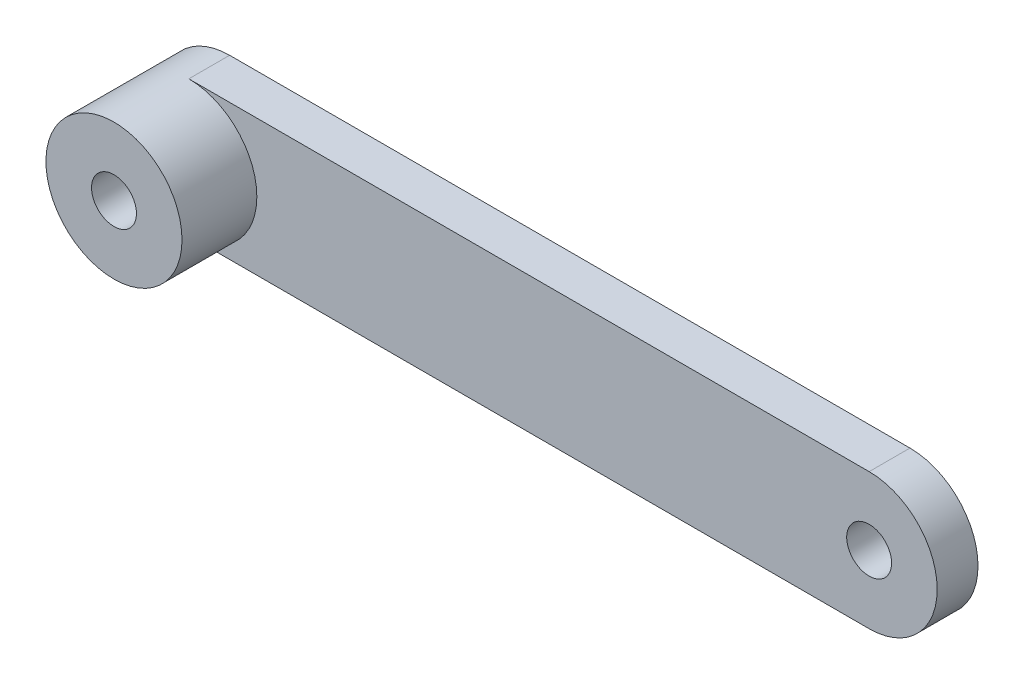
ISO-10303-21;
HEADER;
FILE_DESCRIPTION(('STEP AP214'),'2;1');
FILE_NAME('part.step','',(''),(''),'','','');
FILE_SCHEMA(('AUTOMOTIVE_DESIGN { 1 0 10303 214 1 1 1 1 }'));
ENDSEC;
DATA;
#1=APPLICATION_CONTEXT('core data for automotive mechanical design processes');
#2=APPLICATION_PROTOCOL_DEFINITION('international standard','automotive_design',2000,#1);
#3=PRODUCT_CONTEXT('',#1,'mechanical');
#4=PRODUCT('Part','Part','',(#3));
#5=PRODUCT_RELATED_PRODUCT_CATEGORY('part','',(#4));
#6=PRODUCT_DEFINITION_FORMATION('','',#4);
#7=PRODUCT_DEFINITION_CONTEXT('part definition',#1,'design');
#8=PRODUCT_DEFINITION('design','',#6,#7);
#9=PRODUCT_DEFINITION_SHAPE('','',#8);
#10=(LENGTH_UNIT() NAMED_UNIT(*) SI_UNIT(.MILLI.,.METRE.));
#11=(NAMED_UNIT(*) PLANE_ANGLE_UNIT() SI_UNIT($,.RADIAN.));
#12=(NAMED_UNIT(*) SI_UNIT($,.STERADIAN.) SOLID_ANGLE_UNIT());
#13=UNCERTAINTY_MEASURE_WITH_UNIT(LENGTH_MEASURE(1.E-05),#10,'distance_accuracy_value','');
#14=(GEOMETRIC_REPRESENTATION_CONTEXT(3) GLOBAL_UNCERTAINTY_ASSIGNED_CONTEXT((#13)) GLOBAL_UNIT_ASSIGNED_CONTEXT((#10,
#11,#12)) REPRESENTATION_CONTEXT('',''));
#15=CARTESIAN_POINT('',(0.,0.,0.));
#16=DIRECTION('',(0.,0.,1.));
#17=DIRECTION('',(1.,0.,0.));
#18=AXIS2_PLACEMENT_3D('',#15,#16,#17);
#19=CARTESIAN_POINT('',(0.,0.,3.));
#20=DIRECTION('',(0.,0.,1.));
#21=DIRECTION('',(1.,0.,0.));
#22=AXIS2_PLACEMENT_3D('',#19,#20,#21);
#23=PLANE('',#22);
#24=CARTESIAN_POINT('',(0.,0.,3.));
#25=DIRECTION('',(0.,0.,1.));
#26=DIRECTION('',(1.,0.,0.));
#27=AXIS2_PLACEMENT_3D('',#24,#25,#26);
#28=CIRCLE('',#27,5.);
#29=CARTESIAN_POINT('',(0.,-5.,3.));
#30=VERTEX_POINT('',#29);
#31=CARTESIAN_POINT('',(0.,5.,3.));
#32=VERTEX_POINT('',#31);
#33=EDGE_CURVE('E11',#30,#32,#28,.T.);
#34=ORIENTED_EDGE('',*,*,#33,.F.);
#35=DIRECTION('',(1.,0.,0.));
#36=VECTOR('',#35,1.);
#37=CARTESIAN_POINT('',(0.,-5.,3.));
#38=LINE('',#37,#36);
#39=CARTESIAN_POINT('',(50.,-5.,3.));
#40=VERTEX_POINT('',#39);
#41=EDGE_CURVE('E101',#30,#40,#38,.T.);
#42=ORIENTED_EDGE('',*,*,#41,.T.);
#43=CARTESIAN_POINT('',(50.,0.,3.));
#44=DIRECTION('',(0.,0.,1.));
#45=DIRECTION('',(1.,0.,0.));
#46=AXIS2_PLACEMENT_3D('',#43,#44,#45);
#47=CIRCLE('',#46,5.);
#48=CARTESIAN_POINT('',(50.,5.,3.));
#49=VERTEX_POINT('',#48);
#50=EDGE_CURVE('E52',#40,#49,#47,.T.);
#51=ORIENTED_EDGE('',*,*,#50,.T.);
#52=DIRECTION('',(-1.,0.,0.));
#53=VECTOR('',#52,1.);
#54=CARTESIAN_POINT('',(0.,5.,3.));
#55=LINE('',#54,#53);
#56=EDGE_CURVE('E83',#49,#32,#55,.T.);
#57=ORIENTED_EDGE('',*,*,#56,.T.);
#58=EDGE_LOOP('',(#34,#42,#51,#57));
#59=FACE_BOUND('',#58,.T.);
#60=CARTESIAN_POINT('',(50.,0.,3.));
#61=DIRECTION('',(0.,0.,1.));
#62=DIRECTION('',(1.,0.,0.));
#63=AXIS2_PLACEMENT_3D('',#60,#61,#62);
#64=CIRCLE('',#63,1.65);
#65=CARTESIAN_POINT('',(51.65,0.,3.));
#66=VERTEX_POINT('',#65);
#67=EDGE_CURVE('E119',#66,#66,#64,.T.);
#68=ORIENTED_EDGE('',*,*,#67,.F.);
#69=EDGE_LOOP('',(#68));
#70=FACE_BOUND('',#69,.T.);
#71=ADVANCED_FACE('F33',(#59,#70),#23,.T.);
#72=CARTESIAN_POINT('',(0.,0.,0.));
#73=DIRECTION('',(0.,0.,1.));
#74=DIRECTION('',(1.,0.,0.));
#75=AXIS2_PLACEMENT_3D('',#72,#73,#74);
#76=PLANE('',#75);
#77=CARTESIAN_POINT('',(0.,0.,0.));
#78=DIRECTION('',(0.,0.,1.));
#79=DIRECTION('',(1.,0.,0.));
#80=AXIS2_PLACEMENT_3D('',#77,#78,#79);
#81=CIRCLE('',#80,1.65);
#82=CARTESIAN_POINT('',(1.65,0.,0.));
#83=VERTEX_POINT('',#82);
#84=EDGE_CURVE('E115',#83,#83,#81,.T.);
#85=ORIENTED_EDGE('',*,*,#84,.T.);
#86=EDGE_LOOP('',(#85));
#87=FACE_BOUND('',#86,.T.);
#88=CARTESIAN_POINT('',(0.,0.,0.));
#89=DIRECTION('',(0.,0.,1.));
#90=DIRECTION('',(1.,0.,0.));
#91=AXIS2_PLACEMENT_3D('',#88,#89,#90);
#92=CIRCLE('',#91,5.);
#93=CARTESIAN_POINT('',(0.,5.,0.));
#94=VERTEX_POINT('',#93);
#95=CARTESIAN_POINT('',(0.,-5.,0.));
#96=VERTEX_POINT('',#95);
#97=EDGE_CURVE('E94',#94,#96,#92,.T.);
#98=ORIENTED_EDGE('',*,*,#97,.F.);
#99=DIRECTION('',(-1.,0.,0.));
#100=VECTOR('',#99,1.);
#101=CARTESIAN_POINT('',(0.,5.,0.));
#102=LINE('',#101,#100);
#103=CARTESIAN_POINT('',(50.,5.,0.));
#104=VERTEX_POINT('',#103);
#105=EDGE_CURVE('E75',#104,#94,#102,.T.);
#106=ORIENTED_EDGE('',*,*,#105,.F.);
#107=CARTESIAN_POINT('',(50.,0.,0.));
#108=DIRECTION('',(0.,0.,1.));
#109=DIRECTION('',(1.,0.,0.));
#110=AXIS2_PLACEMENT_3D('',#107,#108,#109);
#111=CIRCLE('',#110,5.);
#112=CARTESIAN_POINT('',(50.,-5.,0.));
#113=VERTEX_POINT('',#112);
#114=EDGE_CURVE('E69',#113,#104,#111,.T.);
#115=ORIENTED_EDGE('',*,*,#114,.F.);
#116=DIRECTION('',(1.,0.,0.));
#117=VECTOR('',#116,1.);
#118=CARTESIAN_POINT('',(0.,-5.,0.));
#119=LINE('',#118,#117);
#120=EDGE_CURVE('E112',#96,#113,#119,.T.);
#121=ORIENTED_EDGE('',*,*,#120,.F.);
#122=EDGE_LOOP('',(#98,#106,#115,#121));
#123=FACE_BOUND('',#122,.T.);
#124=CARTESIAN_POINT('',(50.,0.,0.));
#125=DIRECTION('',(0.,0.,1.));
#126=DIRECTION('',(1.,0.,0.));
#127=AXIS2_PLACEMENT_3D('',#124,#125,#126);
#128=CIRCLE('',#127,1.65);
#129=CARTESIAN_POINT('',(51.65,0.,0.));
#130=VERTEX_POINT('',#129);
#131=EDGE_CURVE('E120',#130,#130,#128,.T.);
#132=ORIENTED_EDGE('',*,*,#131,.T.);
#133=EDGE_LOOP('',(#132));
#134=FACE_BOUND('',#133,.T.);
#135=ADVANCED_FACE('F145',(#87,#123,#134),#76,.F.);
#136=CARTESIAN_POINT('',(0.,0.,3.));
#137=DIRECTION('',(0.,0.,-1.));
#138=DIRECTION('',(-1.,0.,0.));
#139=AXIS2_PLACEMENT_3D('',#136,#137,#138);
#140=CYLINDRICAL_SURFACE('',#139,5.);
#141=ORIENTED_EDGE('',*,*,#97,.T.);
#142=DIRECTION('',(0.,0.,-1.));
#143=VECTOR('',#142,1.);
#144=CARTESIAN_POINT('',(0.,-5.,3.));
#145=LINE('',#144,#143);
#146=EDGE_CURVE('E43',#30,#96,#145,.T.);
#147=ORIENTED_EDGE('',*,*,#146,.F.);
#148=ORIENTED_EDGE('',*,*,#33,.T.);
#149=DIRECTION('',(0.,0.,-1.));
#150=VECTOR('',#149,1.);
#151=CARTESIAN_POINT('',(0.,5.,3.));
#152=LINE('',#151,#150);
#153=EDGE_CURVE('E81',#32,#94,#152,.T.);
#154=ORIENTED_EDGE('',*,*,#153,.T.);
#155=EDGE_LOOP('',(#141,#147,#148,#154));
#156=FACE_BOUND('',#155,.T.);
#157=CARTESIAN_POINT('',(0.,0.,8.5));
#158=DIRECTION('',(0.,0.,1.));
#159=DIRECTION('',(1.,0.,0.));
#160=AXIS2_PLACEMENT_3D('',#157,#158,#159);
#161=CIRCLE('',#160,5.);
#162=CARTESIAN_POINT('',(5.,0.,8.5));
#163=VERTEX_POINT('',#162);
#164=EDGE_CURVE('E123',#163,#163,#161,.T.);
#165=ORIENTED_EDGE('',*,*,#164,.F.);
#166=EDGE_LOOP('',(#165));
#167=FACE_BOUND('',#166,.T.);
#168=ADVANCED_FACE('F35',(#156,#167),#140,.T.);
#169=CARTESIAN_POINT('',(0.,-5.,3.));
#170=DIRECTION('',(0.,1.,0.));
#171=DIRECTION('',(0.,0.,1.));
#172=AXIS2_PLACEMENT_3D('',#169,#170,#171);
#173=PLANE('',#172);
#174=ORIENTED_EDGE('',*,*,#120,.T.);
#175=DIRECTION('',(0.,0.,-1.));
#176=VECTOR('',#175,1.);
#177=CARTESIAN_POINT('',(50.,-5.,3.));
#178=LINE('',#177,#176);
#179=EDGE_CURVE('E96',#40,#113,#178,.T.);
#180=ORIENTED_EDGE('',*,*,#179,.F.);
#181=ORIENTED_EDGE('',*,*,#41,.F.);
#182=ORIENTED_EDGE('',*,*,#146,.T.);
#183=EDGE_LOOP('',(#174,#180,#181,#182));
#184=FACE_BOUND('',#183,.T.);
#185=ADVANCED_FACE('F158',(#184),#173,.F.);
#186=CARTESIAN_POINT('',(50.,0.,3.));
#187=DIRECTION('',(0.,0.,-1.));
#188=DIRECTION('',(-1.,0.,0.));
#189=AXIS2_PLACEMENT_3D('',#186,#187,#188);
#190=CYLINDRICAL_SURFACE('',#189,5.);
#191=ORIENTED_EDGE('',*,*,#114,.T.);
#192=DIRECTION('',(0.,0.,-1.));
#193=VECTOR('',#192,1.);
#194=CARTESIAN_POINT('',(50.,5.,3.));
#195=LINE('',#194,#193);
#196=EDGE_CURVE('E87',#49,#104,#195,.T.);
#197=ORIENTED_EDGE('',*,*,#196,.F.);
#198=ORIENTED_EDGE('',*,*,#50,.F.);
#199=ORIENTED_EDGE('',*,*,#179,.T.);
#200=EDGE_LOOP('',(#191,#197,#198,#199));
#201=FACE_BOUND('',#200,.T.);
#202=ADVANCED_FACE('F156',(#201),#190,.T.);
#203=CARTESIAN_POINT('',(0.,5.,3.));
#204=DIRECTION('',(0.,-1.,0.));
#205=DIRECTION('',(0.,0.,-1.));
#206=AXIS2_PLACEMENT_3D('',#203,#204,#205);
#207=PLANE('',#206);
#208=ORIENTED_EDGE('',*,*,#105,.T.);
#209=ORIENTED_EDGE('',*,*,#153,.F.);
#210=ORIENTED_EDGE('',*,*,#56,.F.);
#211=ORIENTED_EDGE('',*,*,#196,.T.);
#212=EDGE_LOOP('',(#208,#209,#210,#211));
#213=FACE_BOUND('',#212,.T.);
#214=ADVANCED_FACE('F82',(#213),#207,.F.);
#215=CARTESIAN_POINT('',(0.,0.,3.));
#216=DIRECTION('',(0.,0.,-1.));
#217=DIRECTION('',(-1.,0.,0.));
#218=AXIS2_PLACEMENT_3D('',#215,#216,#217);
#219=CYLINDRICAL_SURFACE('',#218,1.65);
#220=ORIENTED_EDGE('',*,*,#84,.F.);
#221=EDGE_LOOP('',(#220));
#222=FACE_BOUND('',#221,.T.);
#223=CARTESIAN_POINT('',(0.,0.,8.5));
#224=DIRECTION('',(0.,0.,1.));
#225=DIRECTION('',(1.,0.,0.));
#226=AXIS2_PLACEMENT_3D('',#223,#224,#225);
#227=CIRCLE('',#226,1.65);
#228=CARTESIAN_POINT('',(1.65,0.,8.5));
#229=VERTEX_POINT('',#228);
#230=EDGE_CURVE('E128',#229,#229,#227,.T.);
#231=ORIENTED_EDGE('',*,*,#230,.T.);
#232=EDGE_LOOP('',(#231));
#233=FACE_BOUND('',#232,.T.);
#234=ADVANCED_FACE('F132',(#222,#233),#219,.F.);
#235=CARTESIAN_POINT('',(50.,0.,3.));
#236=DIRECTION('',(0.,0.,-1.));
#237=DIRECTION('',(-1.,0.,0.));
#238=AXIS2_PLACEMENT_3D('',#235,#236,#237);
#239=CYLINDRICAL_SURFACE('',#238,1.65);
#240=ORIENTED_EDGE('',*,*,#67,.T.);
#241=EDGE_LOOP('',(#240));
#242=FACE_BOUND('',#241,.T.);
#243=ORIENTED_EDGE('',*,*,#131,.F.);
#244=EDGE_LOOP('',(#243));
#245=FACE_BOUND('',#244,.T.);
#246=ADVANCED_FACE('F136',(#242,#245),#239,.F.);
#247=CARTESIAN_POINT('',(0.,0.,8.5));
#248=DIRECTION('',(0.,0.,1.));
#249=DIRECTION('',(1.,0.,0.));
#250=AXIS2_PLACEMENT_3D('',#247,#248,#249);
#251=PLANE('',#250);
#252=ORIENTED_EDGE('',*,*,#164,.T.);
#253=EDGE_LOOP('',(#252));
#254=FACE_BOUND('',#253,.T.);
#255=ORIENTED_EDGE('',*,*,#230,.F.);
#256=EDGE_LOOP('',(#255));
#257=FACE_BOUND('',#256,.T.);
#258=ADVANCED_FACE('F134',(#254,#257),#251,.T.);
#259=CLOSED_SHELL('',(#71,#135,#168,#185,#202,#214,#234,#246,#258));
#260=MANIFOLD_SOLID_BREP('B2',#259);
#261=ADVANCED_BREP_SHAPE_REPRESENTATION('',(#18,#260),#14);
#262=SHAPE_DEFINITION_REPRESENTATION(#9,#261);
ENDSEC;
END-ISO-10303-21;
